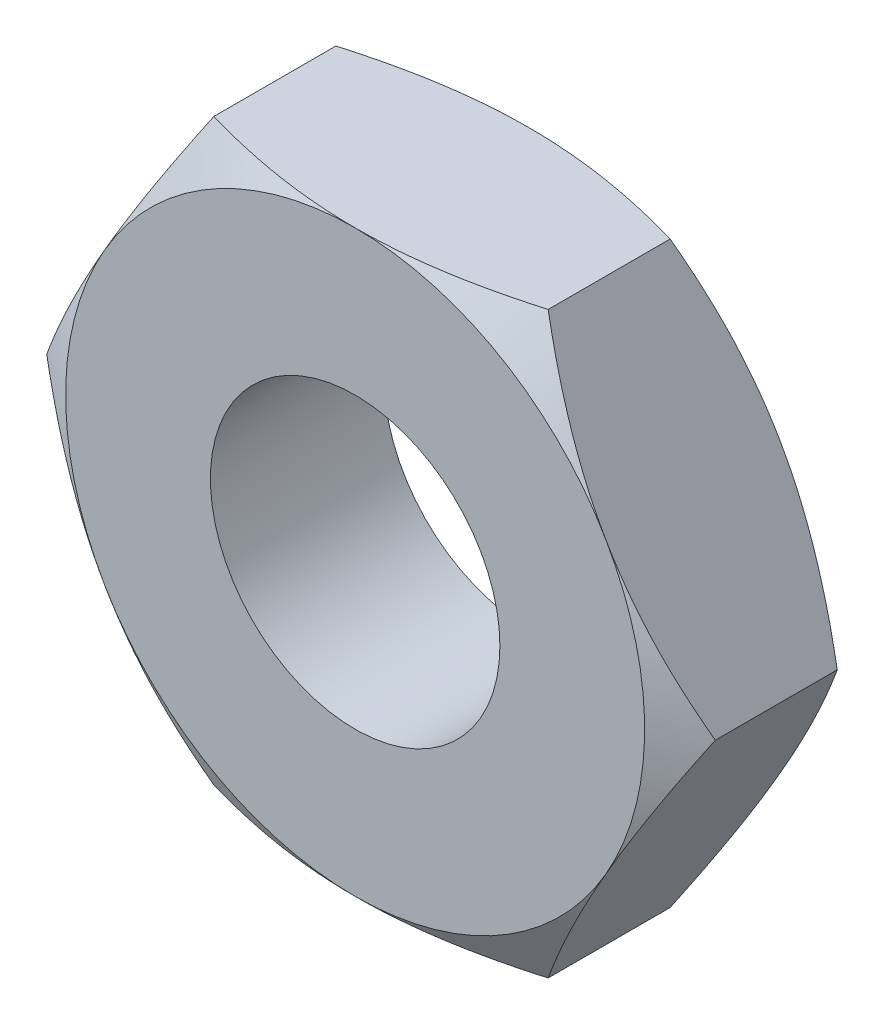
ISO-10303-21;
HEADER;
FILE_DESCRIPTION(('STEP AP214'),'2;1');
FILE_NAME('part.step','',(''),(''),'','','');
FILE_SCHEMA(('AUTOMOTIVE_DESIGN { 1 0 10303 214 1 1 1 1 }'));
ENDSEC;
DATA;
#1=APPLICATION_CONTEXT('core data for automotive mechanical design processes');
#2=APPLICATION_PROTOCOL_DEFINITION('international standard','automotive_design',2000,#1);
#3=PRODUCT_CONTEXT('',#1,'mechanical');
#4=PRODUCT('Part','Part','',(#3));
#5=PRODUCT_RELATED_PRODUCT_CATEGORY('part','',(#4));
#6=PRODUCT_DEFINITION_FORMATION('','',#4);
#7=PRODUCT_DEFINITION_CONTEXT('part definition',#1,'design');
#8=PRODUCT_DEFINITION('design','',#6,#7);
#9=PRODUCT_DEFINITION_SHAPE('','',#8);
#10=(LENGTH_UNIT() NAMED_UNIT(*) SI_UNIT(.MILLI.,.METRE.));
#11=(NAMED_UNIT(*) PLANE_ANGLE_UNIT() SI_UNIT($,.RADIAN.));
#12=(NAMED_UNIT(*) SI_UNIT($,.STERADIAN.) SOLID_ANGLE_UNIT());
#13=UNCERTAINTY_MEASURE_WITH_UNIT(LENGTH_MEASURE(1.E-05),#10,'distance_accuracy_value','');
#14=(GEOMETRIC_REPRESENTATION_CONTEXT(3) GLOBAL_UNCERTAINTY_ASSIGNED_CONTEXT((#13)) GLOBAL_UNIT_ASSIGNED_CONTEXT((#10,
#11,#12)) REPRESENTATION_CONTEXT('',''));
#15=CARTESIAN_POINT('',(0.,0.,0.));
#16=DIRECTION('',(0.,0.,1.));
#17=DIRECTION('',(1.,0.,0.));
#18=AXIS2_PLACEMENT_3D('',#15,#16,#17);
#19=CARTESIAN_POINT('',(2.3094010767585,0.,-1.2));
#20=DIRECTION('',(0.866025403784438,0.5,0.));
#21=DIRECTION('',(-0.5,0.866025403784439,0.));
#22=AXIS2_PLACEMENT_3D('',#19,#20,#21);
#23=PLANE('',#22);
#24=DIRECTION('',(0.,0.,1.));
#25=VECTOR('',#24,1.);
#26=CARTESIAN_POINT('',(2.3094010767585,0.,-1.2));
#27=LINE('',#26,#25);
#28=CARTESIAN_POINT('',(2.3094010767585,0.,-1.02136720504592));
#29=VERTEX_POINT('',#28);
#30=CARTESIAN_POINT('',(2.3094010767585,0.,-0.17863279495408));
#31=VERTEX_POINT('',#30);
#32=EDGE_CURVE('E151',#29,#31,#27,.T.);
#33=ORIENTED_EDGE('',*,*,#32,.F.);
#34=CARTESIAN_POINT('',(2.30951654681234,-0.000199999999999312,-1.0213005333795));
#35=CARTESIAN_POINT('',(2.25877250251758,0.0876912629000608,-1.05061046389932));
#36=CARTESIAN_POINT('',(2.20759044065995,0.176341194473592,-1.07726714801953));
#37=CARTESIAN_POINT('',(2.10433997494456,0.355176246997802,-1.12379750897928));
#38=CARTESIAN_POINT('',(2.0522697359463,0.445364546505037,-1.14365472361722));
#39=CARTESIAN_POINT('',(1.94877459684592,0.624623385763306,-1.17456653597675));
#40=CARTESIAN_POINT('',(1.89736562427197,0.713666338226305,-1.18582684840147));
#41=CARTESIAN_POINT('',(1.79430568008402,0.892171397785044,-1.19927133740536));
#42=CARTESIAN_POINT('',(1.74265508327244,0.981632855703959,-1.20146664504653));
#43=CARTESIAN_POINT('',(1.64613626458981,1.1488083535488,-1.19690901066935));
#44=CARTESIAN_POINT('',(1.60125362236172,1.22654737026578,-1.19127512531299));
#45=CARTESIAN_POINT('',(1.51178075956051,1.38151891453613,-1.17341610473917));
#46=CARTESIAN_POINT('',(1.46719084864821,1.4587509057412,-1.16118486397656));
#47=CARTESIAN_POINT('',(1.37753338590959,1.6140421864822,-1.13060656313239));
#48=CARTESIAN_POINT('',(1.33247718647009,1.69208181310738,-1.11212983293428));
#49=CARTESIAN_POINT('',(1.24303693915875,1.84699686569213,-1.07019448178714));
#50=CARTESIAN_POINT('',(1.1986517446858,1.92387427762312,-1.04674571950769));
#51=CARTESIAN_POINT('',(1.15458506832541,2.0002,-1.0213005333795));
#52=B_SPLINE_CURVE_WITH_KNOTS('',3,(#34,#35,#36,#37,#38,#39,#40,#41,#42,#43,#44,#45,#46,#47,#48,
#49,#50,#51),.UNSPECIFIED.,.F.,.F.,(4,2,2,2,2,2,2,2,4),(0.,0.31703182469561,0.634825876346563,
0.944753967652636,1.25430138000371,1.52387047293094,1.79368946861028,2.06949491027634,
2.34475850821472),.UNSPECIFIED.);
#53=CARTESIAN_POINT('',(1.73205080756888,1.,-1.2));
#54=VERTEX_POINT('',#53);
#55=EDGE_CURVE('E133',#29,#54,#52,.T.);
#56=ORIENTED_EDGE('',*,*,#55,.T.);
#57=CARTESIAN_POINT('',(1.15470053837925,2.,-1.02136720504592));
#58=VERTEX_POINT('',#57);
#59=EDGE_CURVE('E123',#54,#58,#52,.T.);
#60=ORIENTED_EDGE('',*,*,#59,.T.);
#61=DIRECTION('',(0.,0.,1.));
#62=VECTOR('',#61,1.);
#63=CARTESIAN_POINT('',(1.15470053837925,2.,-1.2));
#64=LINE('',#63,#62);
#65=CARTESIAN_POINT('',(1.15470053837925,2.,-0.17863279495408));
#66=VERTEX_POINT('',#65);
#67=EDGE_CURVE('E233',#58,#66,#64,.T.);
#68=ORIENTED_EDGE('',*,*,#67,.T.);
#69=CARTESIAN_POINT('',(1.15458506832541,2.0002,-0.178699466620497));
#70=CARTESIAN_POINT('',(1.20532911262018,1.91230873709994,-0.149389536100678));
#71=CARTESIAN_POINT('',(1.2565111744778,1.82365880552641,-0.122732851980466));
#72=CARTESIAN_POINT('',(1.35976164019319,1.6448237530022,-0.0762024910207205));
#73=CARTESIAN_POINT('',(1.41183187919145,1.55463545349496,-0.0563452763827787));
#74=CARTESIAN_POINT('',(1.51532701829183,1.37537661423669,-0.0254334640232522));
#75=CARTESIAN_POINT('',(1.56673599086578,1.2863336617737,-0.0141731515985309));
#76=CARTESIAN_POINT('',(1.66979593505373,1.10782860221496,-0.000728662594641754));
#77=CARTESIAN_POINT('',(1.72144653186531,1.01836714429604,0.0014666450465319));
#78=CARTESIAN_POINT('',(1.81796535054794,0.851191646451202,-0.00309098933064858));
#79=CARTESIAN_POINT('',(1.86284799277603,0.773452629734217,-0.00872487468701424));
#80=CARTESIAN_POINT('',(1.95232085557725,0.618481085463867,-0.026583895260828));
#81=CARTESIAN_POINT('',(1.99691076648954,0.541249094258802,-0.038815136023439));
#82=CARTESIAN_POINT('',(2.08656822922816,0.3859578135178,-0.0693934368676094));
#83=CARTESIAN_POINT('',(2.13162442866767,0.307918186892621,-0.0878701670657154));
#84=CARTESIAN_POINT('',(2.221064675979,0.153003134307866,-0.129805518212855));
#85=CARTESIAN_POINT('',(2.26544987045196,0.0761257223768809,-0.153254280492313));
#86=CARTESIAN_POINT('',(2.30951654681234,-0.000199999999999199,-0.178699466620497));
#87=B_SPLINE_CURVE_WITH_KNOTS('',3,(#69,#70,#71,#72,#73,#74,#75,#76,#77,#78,#79,#80,#81,#82,#83,
#84,#85,#86),.UNSPECIFIED.,.F.,.F.,(4,2,2,2,2,2,2,2,4),(0.,0.317031824695609,0.634825876346563,
0.944753967652635,1.25430138000371,1.52387047293094,1.79368946861028,2.06949491027634,
2.34475850821472),.UNSPECIFIED.);
#88=CARTESIAN_POINT('',(1.73205080756888,1.,0.));
#89=VERTEX_POINT('',#88);
#90=EDGE_CURVE('E229',#66,#89,#87,.T.);
#91=ORIENTED_EDGE('',*,*,#90,.T.);
#92=EDGE_CURVE('E224',#89,#31,#87,.T.);
#93=ORIENTED_EDGE('',*,*,#92,.T.);
#94=EDGE_LOOP('',(#33,#56,#60,#68,#91,#93));
#95=FACE_BOUND('',#94,.T.);
#96=ADVANCED_FACE('F36',(#95),#23,.T.);
#97=CARTESIAN_POINT('',(1.15470053837925,-2.,-1.2));
#98=DIRECTION('',(0.866025403784439,-0.5,0.));
#99=DIRECTION('',(0.5,0.866025403784439,0.));
#100=AXIS2_PLACEMENT_3D('',#97,#98,#99);
#101=PLANE('',#100);
#102=DIRECTION('',(0.,0.,1.));
#103=VECTOR('',#102,1.);
#104=CARTESIAN_POINT('',(1.15470053837925,-2.,-1.2));
#105=LINE('',#104,#103);
#106=CARTESIAN_POINT('',(1.15470053837925,-2.,-1.02136720504592));
#107=VERTEX_POINT('',#106);
#108=CARTESIAN_POINT('',(1.15470053837925,-2.,-0.17863279495408));
#109=VERTEX_POINT('',#108);
#110=EDGE_CURVE('E239',#107,#109,#105,.T.);
#111=ORIENTED_EDGE('',*,*,#110,.F.);
#112=CARTESIAN_POINT('',(1.15458506832541,-2.0002,-1.0213005333795));
#113=CARTESIAN_POINT('',(1.20532911262018,-1.91230873709994,-1.05061046389932));
#114=CARTESIAN_POINT('',(1.2565111744778,-1.82365880552641,-1.07726714801953));
#115=CARTESIAN_POINT('',(1.35976164019319,-1.6448237530022,-1.12379750897928));
#116=CARTESIAN_POINT('',(1.41183187919145,-1.55463545349496,-1.14365472361722));
#117=CARTESIAN_POINT('',(1.51532701829183,-1.37537661423669,-1.17456653597675));
#118=CARTESIAN_POINT('',(1.56673599086578,-1.2863336617737,-1.18582684840147));
#119=CARTESIAN_POINT('',(1.66979593505373,-1.10782860221496,-1.19927133740536));
#120=CARTESIAN_POINT('',(1.72144653186531,-1.01836714429604,-1.20146664504653));
#121=CARTESIAN_POINT('',(1.81796535054794,-0.851191646451202,-1.19690901066935));
#122=CARTESIAN_POINT('',(1.86284799277603,-0.773452629734217,-1.19127512531299));
#123=CARTESIAN_POINT('',(1.95232085557725,-0.618481085463867,-1.17341610473917));
#124=CARTESIAN_POINT('',(1.99691076648954,-0.541249094258802,-1.16118486397656));
#125=CARTESIAN_POINT('',(2.08656822922816,-0.385957813517799,-1.13060656313239));
#126=CARTESIAN_POINT('',(2.13162442866767,-0.307918186892621,-1.11212983293428));
#127=CARTESIAN_POINT('',(2.221064675979,-0.153003134307865,-1.07019448178714));
#128=CARTESIAN_POINT('',(2.26544987045196,-0.0761257223768795,-1.04674571950769));
#129=CARTESIAN_POINT('',(2.30951654681234,0.000200000000000674,-1.0213005333795));
#130=B_SPLINE_CURVE_WITH_KNOTS('',3,(#112,#113,#114,#115,#116,#117,#118,#119,#120,#121,#122,
#123,#124,#125,#126,#127,#128,#129),.UNSPECIFIED.,.F.,.F.,(4,2,2,2,2,2,2,2,4),(0.,
0.31703182469561,0.634825876346564,0.944753967652636,1.25430138000371,1.52387047293094,
1.79368946861028,2.06949491027634,2.34475850821472),.UNSPECIFIED.);
#131=CARTESIAN_POINT('',(1.73205080756888,-0.999999999999999,-1.2));
#132=VERTEX_POINT('',#131);
#133=EDGE_CURVE('E192',#107,#132,#130,.T.);
#134=ORIENTED_EDGE('',*,*,#133,.T.);
#135=EDGE_CURVE('E139',#132,#29,#130,.T.);
#136=ORIENTED_EDGE('',*,*,#135,.T.);
#137=ORIENTED_EDGE('',*,*,#32,.T.);
#138=CARTESIAN_POINT('',(2.30951654681234,0.000200000000000737,-0.178699466620497));
#139=CARTESIAN_POINT('',(2.25877250251758,-0.0876912629000593,-0.149389536100678));
#140=CARTESIAN_POINT('',(2.20759044065995,-0.176341194473591,-0.122732851980466));
#141=CARTESIAN_POINT('',(2.10433997494456,-0.355176246997801,-0.0762024910207204));
#142=CARTESIAN_POINT('',(2.0522697359463,-0.445364546505036,-0.0563452763827786));
#143=CARTESIAN_POINT('',(1.94877459684592,-0.624623385763305,-0.0254334640232523));
#144=CARTESIAN_POINT('',(1.89736562427197,-0.713666338226303,-0.014173151598531));
#145=CARTESIAN_POINT('',(1.79430568008402,-0.892171397785042,-0.000728662594641788));
#146=CARTESIAN_POINT('',(1.74265508327244,-0.981632855703957,0.00146664504653197));
#147=CARTESIAN_POINT('',(1.64613626458981,-1.1488083535488,-0.00309098933064852));
#148=CARTESIAN_POINT('',(1.60125362236173,-1.22654737026578,-0.00872487468701427));
#149=CARTESIAN_POINT('',(1.51178075956051,-1.38151891453613,-0.026583895260828));
#150=CARTESIAN_POINT('',(1.46719084864821,-1.4587509057412,-0.038815136023439));
#151=CARTESIAN_POINT('',(1.37753338590959,-1.6140421864822,-0.0693934368676094));
#152=CARTESIAN_POINT('',(1.33247718647009,-1.69208181310738,-0.0878701670657155));
#153=CARTESIAN_POINT('',(1.24303693915875,-1.84699686569214,-0.129805518212855));
#154=CARTESIAN_POINT('',(1.1986517446858,-1.92387427762312,-0.153254280492313));
#155=CARTESIAN_POINT('',(1.15458506832541,-2.0002,-0.178699466620497));
#156=B_SPLINE_CURVE_WITH_KNOTS('',3,(#138,#139,#140,#141,#142,#143,#144,#145,#146,#147,#148,
#149,#150,#151,#152,#153,#154,#155),.UNSPECIFIED.,.F.,.F.,(4,2,2,2,2,2,2,2,4),(0.,
0.31703182469561,0.634825876346563,0.944753967652635,1.25430138000371,1.52387047293094,
1.79368946861028,2.06949491027634,2.34475850821472),.UNSPECIFIED.);
#157=CARTESIAN_POINT('',(1.73205080756888,-0.999999999999999,0.));
#158=VERTEX_POINT('',#157);
#159=EDGE_CURVE('E217',#31,#158,#156,.T.);
#160=ORIENTED_EDGE('',*,*,#159,.T.);
#161=EDGE_CURVE('E210',#158,#109,#156,.T.);
#162=ORIENTED_EDGE('',*,*,#161,.T.);
#163=EDGE_LOOP('',(#111,#134,#136,#137,#160,#162));
#164=FACE_BOUND('',#163,.T.);
#165=ADVANCED_FACE('F199',(#164),#101,.T.);
#166=CARTESIAN_POINT('',(-1.15470053837924,-2.,-1.2));
#167=DIRECTION('',(0.,-1.,0.));
#168=DIRECTION('',(1.,0.,0.));
#169=AXIS2_PLACEMENT_3D('',#166,#167,#168);
#170=PLANE('',#169);
#171=DIRECTION('',(0.,0.,1.));
#172=VECTOR('',#171,1.);
#173=CARTESIAN_POINT('',(-1.15470053837924,-2.,-1.2));
#174=LINE('',#173,#172);
#175=CARTESIAN_POINT('',(-1.15470053837925,-2.,-1.02136720504592));
#176=VERTEX_POINT('',#175);
#177=CARTESIAN_POINT('',(-1.15470053837924,-2.,-0.17863279495408));
#178=VERTEX_POINT('',#177);
#179=EDGE_CURVE('E241',#176,#178,#174,.T.);
#180=ORIENTED_EDGE('',*,*,#179,.F.);
#181=CARTESIAN_POINT('',(-3.06243670884926,-2.,-0.242946244298342));
#182=CARTESIAN_POINT('',(-2.97462537456477,-2.,-0.285381534351306));
#183=CARTESIAN_POINT('',(-2.88660642542278,-2.,-0.327394982561969));
#184=CARTESIAN_POINT('',(-2.7100410399043,-2.,-0.410337140450311));
#185=CARTESIAN_POINT('',(-2.62149451540736,-2.,-0.451265662317576));
#186=CARTESIAN_POINT('',(-2.44328340033097,-2.,-0.532012526437257));
#187=CARTESIAN_POINT('',(-2.35361531124172,-2.,-0.571823175245811));
#188=CARTESIAN_POINT('',(-2.17354214087982,-2.,-0.649734508801147));
#189=CARTESIAN_POINT('',(-2.08313709831417,-2.,-0.687835282680517));
#190=CARTESIAN_POINT('',(-1.90031444024273,-2.,-0.762328384320371));
#191=CARTESIAN_POINT('',(-1.80788576524896,-2.,-0.798693718617557));
#192=CARTESIAN_POINT('',(-1.62195726259726,-2.,-0.86856868085399));
#193=CARTESIAN_POINT('',(-1.52845753767457,-2.,-0.902078580127572));
#194=CARTESIAN_POINT('',(-1.34040182163335,-2.,-0.965354047517777));
#195=CARTESIAN_POINT('',(-1.24584841059272,-2.,-0.995127205245311));
#196=CARTESIAN_POINT('',(-1.05539744088343,-2.,-1.04995829551407));
#197=CARTESIAN_POINT('',(-0.959500317628249,-2.,-1.07501771917808));
#198=CARTESIAN_POINT('',(-0.766296162175127,-2.,-1.11920453723145));
#199=CARTESIAN_POINT('',(-0.668988761573955,-2.,-1.13833035125961));
#200=CARTESIAN_POINT('',(-0.473201499243397,-2.,-1.16936309767364));
#201=CARTESIAN_POINT('',(-0.374721636478249,-2.,-1.1812700236818));
#202=CARTESIAN_POINT('',(-0.177725007165872,-2.,-1.19680834640598));
#203=CARTESIAN_POINT('',(-0.0792124969842873,-2.,-1.20049213387509));
#204=CARTESIAN_POINT('',(0.117733470493257,-2.,-1.19940077932984));
#205=CARTESIAN_POINT('',(0.216166941672619,-2.,-1.19462783307904));
#206=CARTESIAN_POINT('',(0.454297669729619,-2.,-1.17327562968436));
#207=CARTESIAN_POINT('',(0.593620948553316,-2.,-1.15251698104436));
#208=CARTESIAN_POINT('',(0.869689823834487,-2.,-1.09780038675936));
#209=CARTESIAN_POINT('',(1.00643218834849,-2.,-1.06382691165978));
#210=CARTESIAN_POINT('',(1.21108764008849,-2.,-1.00524088268493));
#211=CARTESIAN_POINT('',(1.28004713727273,-2.,-0.984142640748009));
#212=CARTESIAN_POINT('',(1.4172425327793,-2.,-0.939857712838905));
#213=CARTESIAN_POINT('',(1.48547889440396,-2.,-0.916672467332592));
#214=CARTESIAN_POINT('',(1.62094752446184,-2.,-0.86869685863592));
#215=CARTESIAN_POINT('',(1.68818328274558,-2.,-0.843916264681625));
#216=CARTESIAN_POINT('',(1.82213314125819,-2.,-0.792900589660032));
#217=CARTESIAN_POINT('',(1.88884701804143,-2.,-0.766664920738091));
#218=CARTESIAN_POINT('',(1.95531919268194,-2.,-0.739845215110288));
#219=B_SPLINE_CURVE_WITH_KNOTS('',3,(#181,#182,#183,#184,#185,#186,#187,#188,#189,#190,#191,
#192,#193,#194,#195,#196,#197,#198,#199,#200,#201,#202,#203,#204,#205,#206,#207,#208,#209,#210,
#211,#212,#213,#214,#215,#216,#217,#218),.UNSPECIFIED.,.F.,.F.,(4,2,2,2,2,2,2,2,2,2,2,2,2,2,2,2,
2,2,4),(0.,0.292585981547725,0.585222285876961,0.879533230089777,1.17382881455956,
1.47176815658413,1.76967915563007,2.06697493039128,2.36417650111644,2.66145716086699,
2.95873808325712,3.2541195157486,3.54942426464478,3.9711430779806,4.39335898038569,
4.60967797518337,4.82584879332086,5.04080285667119,5.25584440381786),.UNSPECIFIED.);
#220=CARTESIAN_POINT('',(0.,-2.,-1.2));
#221=VERTEX_POINT('',#220);
#222=EDGE_CURVE('E318',#176,#221,#219,.T.);
#223=ORIENTED_EDGE('',*,*,#222,.T.);
#224=EDGE_CURVE('E193',#221,#107,#219,.T.);
#225=ORIENTED_EDGE('',*,*,#224,.T.);
#226=ORIENTED_EDGE('',*,*,#110,.T.);
#227=CARTESIAN_POINT('',(-3.06243670884926,-2.,-0.957053755701653));
#228=CARTESIAN_POINT('',(-2.97462537456477,-2.,-0.91461846564869));
#229=CARTESIAN_POINT('',(-2.88660642542278,-2.,-0.872605017438026));
#230=CARTESIAN_POINT('',(-2.7100410399043,-2.,-0.789662859549685));
#231=CARTESIAN_POINT('',(-2.62149451540736,-2.,-0.74873433768242));
#232=CARTESIAN_POINT('',(-2.44328340033097,-2.,-0.66798747356274));
#233=CARTESIAN_POINT('',(-2.35361531124171,-2.,-0.628176824754186));
#234=CARTESIAN_POINT('',(-2.17354214087982,-2.,-0.55026549119885));
#235=CARTESIAN_POINT('',(-2.08313709831417,-2.,-0.51216471731948));
#236=CARTESIAN_POINT('',(-1.90031444024273,-2.,-0.437671615679627));
#237=CARTESIAN_POINT('',(-1.80788576524895,-2.,-0.40130628138244));
#238=CARTESIAN_POINT('',(-1.62195726259725,-2.,-0.331431319146008));
#239=CARTESIAN_POINT('',(-1.52845753767457,-2.,-0.297921419872426));
#240=CARTESIAN_POINT('',(-1.34040182163335,-2.,-0.234645952482221));
#241=CARTESIAN_POINT('',(-1.24584841059272,-2.,-0.204872794754688));
#242=CARTESIAN_POINT('',(-1.05539744088343,-2.,-0.150041704485925));
#243=CARTESIAN_POINT('',(-0.959500317628249,-2.,-0.124982280821916));
#244=CARTESIAN_POINT('',(-0.766296162175126,-2.,-0.0807954627685529));
#245=CARTESIAN_POINT('',(-0.668988761573955,-2.,-0.0616696487403929));
#246=CARTESIAN_POINT('',(-0.473201499243398,-2.,-0.0306369023263644));
#247=CARTESIAN_POINT('',(-0.37472163647825,-2.,-0.0187299763182013));
#248=CARTESIAN_POINT('',(-0.177725007165873,-2.,-0.00319165359402001));
#249=CARTESIAN_POINT('',(-0.079212496984288,-2.,0.000492133875092076));
#250=CARTESIAN_POINT('',(0.117733470493257,-2.,-0.000599220670161883));
#251=CARTESIAN_POINT('',(0.216166941672618,-2.,-0.00537216692095547));
#252=CARTESIAN_POINT('',(0.454297669729619,-2.,-0.0267243703156365));
#253=CARTESIAN_POINT('',(0.593620948553316,-2.,-0.0474830189556355));
#254=CARTESIAN_POINT('',(0.86968982383449,-2.,-0.102199613240639));
#255=CARTESIAN_POINT('',(1.0064321883485,-2.,-0.136173088340221));
#256=CARTESIAN_POINT('',(1.21108764008849,-2.,-0.194759117315066));
#257=CARTESIAN_POINT('',(1.28004713727273,-2.,-0.215857359251991));
#258=CARTESIAN_POINT('',(1.41724253277931,-2.,-0.260142287161096));
#259=CARTESIAN_POINT('',(1.48547889440396,-2.,-0.283327532667408));
#260=CARTESIAN_POINT('',(1.62094752446184,-2.,-0.33130314136408));
#261=CARTESIAN_POINT('',(1.68818328274558,-2.,-0.356083735318376));
#262=CARTESIAN_POINT('',(1.8221331412582,-2.,-0.407099410339969));
#263=CARTESIAN_POINT('',(1.88884701804143,-2.,-0.433335079261909));
#264=CARTESIAN_POINT('',(1.95531919268194,-2.,-0.460154784889712));
#265=B_SPLINE_CURVE_WITH_KNOTS('',3,(#227,#228,#229,#230,#231,#232,#233,#234,#235,#236,#237,
#238,#239,#240,#241,#242,#243,#244,#245,#246,#247,#248,#249,#250,#251,#252,#253,#254,#255,#256,
#257,#258,#259,#260,#261,#262,#263,#264),.UNSPECIFIED.,.F.,.F.,(4,2,2,2,2,2,2,2,2,2,2,2,2,2,2,2,
2,2,4),(0.,0.292585981547725,0.585222285876962,0.879533230089778,1.17382881455956,
1.47176815658413,1.76967915563007,2.06697493039128,2.36417650111644,2.66145716086699,
2.95873808325711,3.2541195157486,3.54942426464477,3.9711430779806,4.39335898038569,
4.60967797518337,4.82584879332087,5.04080285667119,5.25584440381786),.UNSPECIFIED.);
#266=CARTESIAN_POINT('',(0.,-2.,0.));
#267=VERTEX_POINT('',#266);
#268=EDGE_CURVE('E218',#109,#267,#265,.F.);
#269=ORIENTED_EDGE('',*,*,#268,.T.);
#270=EDGE_CURVE('E219',#267,#178,#265,.F.);
#271=ORIENTED_EDGE('',*,*,#270,.T.);
#272=EDGE_LOOP('',(#180,#223,#225,#226,#269,#271));
#273=FACE_BOUND('',#272,.T.);
#274=ADVANCED_FACE('F203',(#273),#170,.T.);
#275=CARTESIAN_POINT('',(-2.3094010767585,0.,-1.2));
#276=DIRECTION('',(-0.866025403784438,-0.500000000000001,0.));
#277=DIRECTION('',(0.500000000000001,-0.866025403784438,0.));
#278=AXIS2_PLACEMENT_3D('',#275,#276,#277);
#279=PLANE('',#278);
#280=DIRECTION('',(0.,0.,1.));
#281=VECTOR('',#280,1.);
#282=CARTESIAN_POINT('',(-2.3094010767585,0.,-1.2));
#283=LINE('',#282,#281);
#284=CARTESIAN_POINT('',(-2.3094010767585,0.,-1.02136720504592));
#285=VERTEX_POINT('',#284);
#286=CARTESIAN_POINT('',(-2.3094010767585,0.,-0.17863279495408));
#287=VERTEX_POINT('',#286);
#288=EDGE_CURVE('E243',#285,#287,#283,.T.);
#289=ORIENTED_EDGE('',*,*,#288,.F.);
#290=CARTESIAN_POINT('',(-2.30951654681234,0.00019999999999843,-1.0213005333795));
#291=CARTESIAN_POINT('',(-2.25877250251757,-0.0876912629000613,-1.05061046389932));
#292=CARTESIAN_POINT('',(-2.20759044065995,-0.176341194473593,-1.07726714801954));
#293=CARTESIAN_POINT('',(-2.10433997494456,-0.355176246997803,-1.12379750897928));
#294=CARTESIAN_POINT('',(-2.0522697359463,-0.445364546505037,-1.14365472361722));
#295=CARTESIAN_POINT('',(-1.94877459684592,-0.624623385763306,-1.17456653597675));
#296=CARTESIAN_POINT('',(-1.89736562427197,-0.713666338226304,-1.18582684840147));
#297=CARTESIAN_POINT('',(-1.79430568008402,-0.892171397785042,-1.19927133740536));
#298=CARTESIAN_POINT('',(-1.74265508327244,-0.981632855703957,-1.20146664504653));
#299=CARTESIAN_POINT('',(-1.64613626458981,-1.1488083535488,-1.19690901066935));
#300=CARTESIAN_POINT('',(-1.60125362236172,-1.22654737026578,-1.19127512531299));
#301=CARTESIAN_POINT('',(-1.5117807595605,-1.38151891453613,-1.17341610473917));
#302=CARTESIAN_POINT('',(-1.46719084864821,-1.4587509057412,-1.16118486397656));
#303=CARTESIAN_POINT('',(-1.37753338590959,-1.6140421864822,-1.13060656313239));
#304=CARTESIAN_POINT('',(-1.33247718647008,-1.69208181310738,-1.11212983293429));
#305=CARTESIAN_POINT('',(-1.24303693915875,-1.84699686569214,-1.07019448178715));
#306=CARTESIAN_POINT('',(-1.19865174468579,-1.92387427762312,-1.04674571950769));
#307=CARTESIAN_POINT('',(-1.15458506832541,-2.0002,-1.0213005333795));
#308=B_SPLINE_CURVE_WITH_KNOTS('',3,(#290,#291,#292,#293,#294,#295,#296,#297,#298,#299,#300,
#301,#302,#303,#304,#305,#306,#307),.UNSPECIFIED.,.F.,.F.,(4,2,2,2,2,2,2,2,4),(0.,
0.317031824695609,0.634825876346562,0.944753967652634,1.25430138000371,1.52387047293094,
1.79368946861028,2.06949491027634,2.34475850821473),.UNSPECIFIED.);
#309=CARTESIAN_POINT('',(-1.73205080756888,-1.,-1.2));
#310=VERTEX_POINT('',#309);
#311=EDGE_CURVE('E154',#285,#310,#308,.T.);
#312=ORIENTED_EDGE('',*,*,#311,.T.);
#313=EDGE_CURVE('E322',#310,#176,#308,.T.);
#314=ORIENTED_EDGE('',*,*,#313,.T.);
#315=ORIENTED_EDGE('',*,*,#179,.T.);
#316=CARTESIAN_POINT('',(-1.15458506832541,-2.0002,-0.178699466620496));
#317=CARTESIAN_POINT('',(-1.20532911262017,-1.91230873709994,-0.149389536100677));
#318=CARTESIAN_POINT('',(-1.25651117447779,-1.82365880552641,-0.122732851980465));
#319=CARTESIAN_POINT('',(-1.35976164019319,-1.6448237530022,-0.0762024910207194));
#320=CARTESIAN_POINT('',(-1.41183187919144,-1.55463545349497,-0.0563452763827774));
#321=CARTESIAN_POINT('',(-1.51532701829182,-1.3753766142367,-0.0254334640232507));
#322=CARTESIAN_POINT('',(-1.56673599086578,-1.2863336617737,-0.0141731515985293));
#323=CARTESIAN_POINT('',(-1.66979593505372,-1.10782860221496,-0.000728662594639881));
#324=CARTESIAN_POINT('',(-1.72144653186531,-1.01836714429605,0.00146664504653401));
#325=CARTESIAN_POINT('',(-1.81796535054793,-0.851191646451206,-0.00309098933064626));
#326=CARTESIAN_POINT('',(-1.86284799277602,-0.77345262973422,-0.00872487468701195));
#327=CARTESIAN_POINT('',(-1.95232085557724,-0.61848108546387,-0.0265838952608255));
#328=CARTESIAN_POINT('',(-1.99691076648954,-0.541249094258805,-0.0388151360234364));
#329=CARTESIAN_POINT('',(-2.08656822922816,-0.385957813517802,-0.0693934368676067));
#330=CARTESIAN_POINT('',(-2.13162442866766,-0.307918186892623,-0.0878701670657127));
#331=CARTESIAN_POINT('',(-2.221064675979,-0.153003134307867,-0.129805518212853));
#332=CARTESIAN_POINT('',(-2.26544987045195,-0.0761257223768817,-0.15325428049231));
#333=CARTESIAN_POINT('',(-2.30951654681234,0.000199999999998705,-0.178699466620495));
#334=B_SPLINE_CURVE_WITH_KNOTS('',3,(#316,#317,#318,#319,#320,#321,#322,#323,#324,#325,#326,
#327,#328,#329,#330,#331,#332,#333),.UNSPECIFIED.,.F.,.F.,(4,2,2,2,2,2,2,2,4),(0.,
0.31703182469561,0.634825876346563,0.944753967652634,1.25430138000371,1.52387047293094,
1.79368946861028,2.06949491027634,2.34475850821473),.UNSPECIFIED.);
#335=CARTESIAN_POINT('',(-1.73205080756888,-1.,0.));
#336=VERTEX_POINT('',#335);
#337=EDGE_CURVE('E283',#178,#336,#334,.T.);
#338=ORIENTED_EDGE('',*,*,#337,.T.);
#339=EDGE_CURVE('E284',#336,#287,#334,.T.);
#340=ORIENTED_EDGE('',*,*,#339,.T.);
#341=EDGE_LOOP('',(#289,#312,#314,#315,#338,#340));
#342=FACE_BOUND('',#341,.T.);
#343=ADVANCED_FACE('F297',(#342),#279,.T.);
#344=CARTESIAN_POINT('',(-1.15470053837925,2.,-1.2));
#345=DIRECTION('',(-0.866025403784439,0.499999999999999,0.));
#346=DIRECTION('',(-0.5,-0.866025403784439,0.));
#347=AXIS2_PLACEMENT_3D('',#344,#345,#346);
#348=PLANE('',#347);
#349=DIRECTION('',(0.,0.,1.));
#350=VECTOR('',#349,1.);
#351=CARTESIAN_POINT('',(-1.15470053837925,2.,-1.2));
#352=LINE('',#351,#350);
#353=CARTESIAN_POINT('',(-1.15470053837925,2.,-1.02136720504592));
#354=VERTEX_POINT('',#353);
#355=CARTESIAN_POINT('',(-1.15470053837925,2.,-0.17863279495408));
#356=VERTEX_POINT('',#355);
#357=EDGE_CURVE('E245',#354,#356,#352,.T.);
#358=ORIENTED_EDGE('',*,*,#357,.F.);
#359=CARTESIAN_POINT('',(-1.15458506832541,2.0002,-1.0213005333795));
#360=CARTESIAN_POINT('',(-1.20532911262018,1.91230873709994,-1.05061046389932));
#361=CARTESIAN_POINT('',(-1.2565111744778,1.82365880552641,-1.07726714801953));
#362=CARTESIAN_POINT('',(-1.35976164019319,1.6448237530022,-1.12379750897928));
#363=CARTESIAN_POINT('',(-1.41183187919145,1.55463545349496,-1.14365472361722));
#364=CARTESIAN_POINT('',(-1.51532701829183,1.37537661423669,-1.17456653597675));
#365=CARTESIAN_POINT('',(-1.56673599086578,1.2863336617737,-1.18582684840147));
#366=CARTESIAN_POINT('',(-1.66979593505373,1.10782860221496,-1.19927133740536));
#367=CARTESIAN_POINT('',(-1.72144653186531,1.01836714429604,-1.20146664504653));
#368=CARTESIAN_POINT('',(-1.81796535054794,0.851191646451202,-1.19690901066935));
#369=CARTESIAN_POINT('',(-1.86284799277602,0.773452629734216,-1.19127512531299));
#370=CARTESIAN_POINT('',(-1.95232085557724,0.618481085463866,-1.17341610473917));
#371=CARTESIAN_POINT('',(-1.99691076648954,0.541249094258801,-1.16118486397656));
#372=CARTESIAN_POINT('',(-2.08656822922816,0.385957813517799,-1.13060656313239));
#373=CARTESIAN_POINT('',(-2.13162442866766,0.30791818689262,-1.11212983293429));
#374=CARTESIAN_POINT('',(-2.221064675979,0.153003134307864,-1.07019448178715));
#375=CARTESIAN_POINT('',(-2.26544987045195,0.0761257223768789,-1.04674571950769));
#376=CARTESIAN_POINT('',(-2.30951654681234,-0.000200000000001487,-1.0213005333795));
#377=B_SPLINE_CURVE_WITH_KNOTS('',3,(#359,#360,#361,#362,#363,#364,#365,#366,#367,#368,#369,
#370,#371,#372,#373,#374,#375,#376),.UNSPECIFIED.,.F.,.F.,(4,2,2,2,2,2,2,2,4),(0.,
0.31703182469561,0.634825876346563,0.944753967652635,1.25430138000371,1.52387047293094,
1.79368946861028,2.06949491027634,2.34475850821472),.UNSPECIFIED.);
#378=CARTESIAN_POINT('',(-1.73205080756888,0.999999999999999,-1.2));
#379=VERTEX_POINT('',#378);
#380=EDGE_CURVE('E54',#354,#379,#377,.T.);
#381=ORIENTED_EDGE('',*,*,#380,.T.);
#382=EDGE_CURVE('E152',#379,#285,#377,.T.);
#383=ORIENTED_EDGE('',*,*,#382,.T.);
#384=ORIENTED_EDGE('',*,*,#288,.T.);
#385=CARTESIAN_POINT('',(-2.30951654681234,-0.000200000000001596,-0.178699466620494));
#386=CARTESIAN_POINT('',(-2.25877250251757,0.0876912629000585,-0.149389536100676));
#387=CARTESIAN_POINT('',(-2.20759044065995,0.17634119447359,-0.122732851980464));
#388=CARTESIAN_POINT('',(-2.10433997494456,0.3551762469978,-0.0762024910207184));
#389=CARTESIAN_POINT('',(-2.0522697359463,0.445364546505034,-0.0563452763827766));
#390=CARTESIAN_POINT('',(-1.94877459684592,0.624623385763303,-0.0254334640232503));
#391=CARTESIAN_POINT('',(-1.89736562427197,0.713666338226301,-0.014173151598529));
#392=CARTESIAN_POINT('',(-1.79430568008402,0.89217139778504,-0.000728662594639785));
#393=CARTESIAN_POINT('',(-1.74265508327244,0.981632855703955,0.00146664504653397));
#394=CARTESIAN_POINT('',(-1.64613626458981,1.14880835354879,-0.00309098933064657));
#395=CARTESIAN_POINT('',(-1.60125362236172,1.22654737026578,-0.00872487468701237));
#396=CARTESIAN_POINT('',(-1.5117807595605,1.38151891453613,-0.0265838952608262));
#397=CARTESIAN_POINT('',(-1.46719084864821,1.4587509057412,-0.0388151360234372));
#398=CARTESIAN_POINT('',(-1.37753338590959,1.6140421864822,-0.0693934368676076));
#399=CARTESIAN_POINT('',(-1.33247718647008,1.69208181310738,-0.0878701670657137));
#400=CARTESIAN_POINT('',(-1.24303693915875,1.84699686569213,-0.129805518212853));
#401=CARTESIAN_POINT('',(-1.19865174468579,1.92387427762312,-0.153254280492311));
#402=CARTESIAN_POINT('',(-1.15458506832541,2.0002,-0.178699466620495));
#403=B_SPLINE_CURVE_WITH_KNOTS('',3,(#385,#386,#387,#388,#389,#390,#391,#392,#393,#394,#395,
#396,#397,#398,#399,#400,#401,#402),.UNSPECIFIED.,.F.,.F.,(4,2,2,2,2,2,2,2,4),(0.,
0.317031824695609,0.634825876346562,0.944753967652633,1.25430138000371,1.52387047293093,
1.79368946861028,2.06949491027634,2.34475850821472),.UNSPECIFIED.);
#404=CARTESIAN_POINT('',(-1.73205080756888,0.999999999999999,0.));
#405=VERTEX_POINT('',#404);
#406=EDGE_CURVE('E287',#287,#405,#403,.T.);
#407=ORIENTED_EDGE('',*,*,#406,.T.);
#408=EDGE_CURVE('E292',#405,#356,#403,.T.);
#409=ORIENTED_EDGE('',*,*,#408,.T.);
#410=EDGE_LOOP('',(#358,#381,#383,#384,#407,#409));
#411=FACE_BOUND('',#410,.T.);
#412=ADVANCED_FACE('F300',(#411),#348,.T.);
#413=CARTESIAN_POINT('',(1.15470053837925,2.,-1.2));
#414=DIRECTION('',(0.,1.,0.));
#415=DIRECTION('',(-1.,0.,0.));
#416=AXIS2_PLACEMENT_3D('',#413,#414,#415);
#417=PLANE('',#416);
#418=ORIENTED_EDGE('',*,*,#67,.F.);
#419=CARTESIAN_POINT('',(-3.06243599497945,2.,-0.242946589379689));
#420=CARTESIAN_POINT('',(-2.97462468513201,2.,-0.285381864667557));
#421=CARTESIAN_POINT('',(-2.88660576044574,2.,-0.327395298121811));
#422=CARTESIAN_POINT('',(-2.71004042392045,2.,-0.41033742657592));
#423=CARTESIAN_POINT('',(-2.62149392396102,2.,-0.451265933765376));
#424=CARTESIAN_POINT('',(-2.44328285836992,2.,-0.532012768522036));
#425=CARTESIAN_POINT('',(-2.35361479423019,2.,-0.571823402648508));
#426=CARTESIAN_POINT('',(-2.17354167395291,2.,-0.649734707109847));
#427=CARTESIAN_POINT('',(-2.08313665652234,2.,-0.687835466577276));
#428=CARTESIAN_POINT('',(-1.90031404940484,2.,-0.762328539637907));
#429=CARTESIAN_POINT('',(-1.80788540023433,2.,-0.798693859775678));
#430=CARTESIAN_POINT('',(-1.6219569496476,2.,-0.86856879448493));
#431=CARTESIAN_POINT('',(-1.52845725096657,2.,-0.902078680390603));
#432=CARTESIAN_POINT('',(-1.34040158791133,2.,-0.965354122372861));
#433=CARTESIAN_POINT('',(-1.24584820361333,2.,-0.995127268056318));
#434=CARTESIAN_POINT('',(-1.05539728812542,2.,-1.0499583362749));
#435=CARTESIAN_POINT('',(-0.959500192348558,2.,-1.07501774993149));
#436=CARTESIAN_POINT('',(-0.766296107056171,2.,-1.11920454773855));
#437=CARTESIAN_POINT('',(-0.668988749343048,2.,-1.13833035240976));
#438=CARTESIAN_POINT('',(-0.473201573751657,2.,-1.16936308665098));
#439=CARTESIAN_POINT('',(-0.374721754836863,2.,-1.18127000983859));
#440=CARTESIAN_POINT('',(-0.177725213014455,2.,-1.19680833464032));
#441=CARTESIAN_POINT('',(-0.0792127464695915,2.,-1.20049212694298));
#442=CARTESIAN_POINT('',(0.117733134481548,2.,-1.19940078951715));
#443=CARTESIAN_POINT('',(0.216166562771046,2.,-1.19462785555389));
#444=CARTESIAN_POINT('',(0.454297223248129,2.,-1.17327568608797));
#445=CARTESIAN_POINT('',(0.593620477818544,2.,-1.15251705811094));
#446=CARTESIAN_POINT('',(0.86968930625478,2.,-1.09780050572932));
#447=CARTESIAN_POINT('',(1.00643164818023,2.,-1.06382705187579));
#448=CARTESIAN_POINT('',(1.21108706615396,2.,-1.00524105434464));
#449=CARTESIAN_POINT('',(1.28004655189502,2.,-0.984142822967431));
#450=CARTESIAN_POINT('',(1.41724192464573,2.,-0.939857915871669));
#451=CARTESIAN_POINT('',(1.4854782749575,2.,-0.916672680618839));
#452=CARTESIAN_POINT('',(1.62094688255355,2.,-0.868697092028027));
#453=CARTESIAN_POINT('',(1.68818262968756,2.,-0.843916507926394));
#454=CARTESIAN_POINT('',(1.82213246587636,2.,-0.79290085231338));
#455=CARTESIAN_POINT('',(1.88884633148567,2.,-0.766665192947669));
#456=CARTESIAN_POINT('',(1.95531849493344,2.,-0.739845496729099));
#457=B_SPLINE_CURVE_WITH_KNOTS('',3,(#419,#420,#421,#422,#423,#424,#425,#426,#427,#428,#429,
#430,#431,#432,#433,#434,#435,#436,#437,#438,#439,#440,#441,#442,#443,#444,#445,#446,#447,#448,
#449,#450,#451,#452,#453,#454,#455,#456),.UNSPECIFIED.,.F.,.F.,(4,2,2,2,2,2,2,2,2,2,2,2,2,2,2,2,
2,2,4),(0.,0.292585896266135,0.585222115299634,0.879532973229948,1.17382847142413,
1.47176772581358,1.76967863724006,2.06697432467462,2.36417580814397,2.66145633652584,
2.95873712774068,3.2541184304568,3.54942304948605,3.97114178181683,4.39335760296179,
4.60967655565109,4.82584733174413,5.0408013534775,5.25584285892499),.UNSPECIFIED.);
#458=CARTESIAN_POINT('',(0.,2.,-1.2));
#459=VERTEX_POINT('',#458);
#460=EDGE_CURVE('E129',#58,#459,#457,.F.);
#461=ORIENTED_EDGE('',*,*,#460,.T.);
#462=EDGE_CURVE('E147',#459,#354,#457,.F.);
#463=ORIENTED_EDGE('',*,*,#462,.T.);
#464=ORIENTED_EDGE('',*,*,#357,.T.);
#465=CARTESIAN_POINT('',(-3.06243599497945,2.,-0.957053410620308));
#466=CARTESIAN_POINT('',(-2.97462468513201,2.,-0.914618135332439));
#467=CARTESIAN_POINT('',(-2.88660576044574,2.,-0.872604701878186));
#468=CARTESIAN_POINT('',(-2.71004042392046,2.,-0.789662573424077));
#469=CARTESIAN_POINT('',(-2.62149392396102,2.,-0.748734066234621));
#470=CARTESIAN_POINT('',(-2.44328285836992,2.,-0.667987231477961));
#471=CARTESIAN_POINT('',(-2.35361479423019,2.,-0.62817659735149));
#472=CARTESIAN_POINT('',(-2.17354167395291,2.,-0.55026529289015));
#473=CARTESIAN_POINT('',(-2.08313665652234,2.,-0.512164533422722));
#474=CARTESIAN_POINT('',(-1.90031404940484,2.,-0.437671460362091));
#475=CARTESIAN_POINT('',(-1.80788540023433,2.,-0.40130614022432));
#476=CARTESIAN_POINT('',(-1.6219569496476,2.,-0.331431205515068));
#477=CARTESIAN_POINT('',(-1.52845725096657,2.,-0.297921319609396));
#478=CARTESIAN_POINT('',(-1.34040158791133,2.,-0.234645877627138));
#479=CARTESIAN_POINT('',(-1.24584820361333,2.,-0.204872731943681));
#480=CARTESIAN_POINT('',(-1.05539728812542,2.,-0.150041663725094));
#481=CARTESIAN_POINT('',(-0.959500192348558,2.,-0.124982250068509));
#482=CARTESIAN_POINT('',(-0.766296107056171,2.,-0.0807954522614493));
#483=CARTESIAN_POINT('',(-0.668988749343048,2.,-0.0616696475902373));
#484=CARTESIAN_POINT('',(-0.473201573751656,2.,-0.0306369133490205));
#485=CARTESIAN_POINT('',(-0.374721754836863,2.,-0.0187299901614142));
#486=CARTESIAN_POINT('',(-0.177725213014454,2.,-0.00319166535968425));
#487=CARTESIAN_POINT('',(-0.0792127464695915,2.,0.000492126942979159));
#488=CARTESIAN_POINT('',(0.117733134481547,2.,-0.000599210482845376));
#489=CARTESIAN_POINT('',(0.216166562771046,2.,-0.00537214444610993));
#490=CARTESIAN_POINT('',(0.454297223248128,2.,-0.0267243139120264));
#491=CARTESIAN_POINT('',(0.593620477818545,2.,-0.0474829418890647));
#492=CARTESIAN_POINT('',(0.869689306254782,2.,-0.10219949427068));
#493=CARTESIAN_POINT('',(1.00643164818023,2.,-0.136172948124205));
#494=CARTESIAN_POINT('',(1.21108706615396,2.,-0.194758945655364));
#495=CARTESIAN_POINT('',(1.28004655189503,2.,-0.215857177032569));
#496=CARTESIAN_POINT('',(1.41724192464573,2.,-0.260142084128331));
#497=CARTESIAN_POINT('',(1.4854782749575,2.,-0.283327319381161));
#498=CARTESIAN_POINT('',(1.62094688255355,2.,-0.331302907971973));
#499=CARTESIAN_POINT('',(1.68818262968757,2.,-0.356083492073606));
#500=CARTESIAN_POINT('',(1.82213246587637,2.,-0.407099147686621));
#501=CARTESIAN_POINT('',(1.88884633148568,2.,-0.433334807052332));
#502=CARTESIAN_POINT('',(1.95531849493344,2.,-0.460154503270902));
#503=B_SPLINE_CURVE_WITH_KNOTS('',3,(#465,#466,#467,#468,#469,#470,#471,#472,#473,#474,#475,
#476,#477,#478,#479,#480,#481,#482,#483,#484,#485,#486,#487,#488,#489,#490,#491,#492,#493,#494,
#495,#496,#497,#498,#499,#500,#501,#502),.UNSPECIFIED.,.F.,.F.,(4,2,2,2,2,2,2,2,2,2,2,2,2,2,2,2,
2,2,4),(0.,0.292585896266135,0.585222115299633,0.879532973229947,1.17382847142413,
1.47176772581358,1.76967863724006,2.06697432467462,2.36417580814397,2.66145633652584,
2.95873712774068,3.2541184304568,3.54942304948605,3.97114178181683,4.39335760296179,
4.60967655565109,4.82584733174413,5.0408013534775,5.255842858925),.UNSPECIFIED.);
#504=CARTESIAN_POINT('',(0.,2.,0.));
#505=VERTEX_POINT('',#504);
#506=EDGE_CURVE('E316',#356,#505,#503,.T.);
#507=ORIENTED_EDGE('',*,*,#506,.T.);
#508=EDGE_CURVE('E311',#505,#66,#503,.T.);
#509=ORIENTED_EDGE('',*,*,#508,.T.);
#510=EDGE_LOOP('',(#418,#461,#463,#464,#507,#509));
#511=FACE_BOUND('',#510,.T.);
#512=ADVANCED_FACE('F304',(#511),#417,.T.);
#513=CARTESIAN_POINT('',(3.46410161513775,-2.,-1.2));
#514=DIRECTION('',(0.,0.,-1.));
#515=DIRECTION('',(-1.,0.,0.));
#516=AXIS2_PLACEMENT_3D('',#513,#514,#515);
#517=PLANE('',#516);
#518=CARTESIAN_POINT('',(0.,0.,-1.2));
#519=DIRECTION('',(0.,0.,1.));
#520=DIRECTION('',(1.,0.,0.));
#521=AXIS2_PLACEMENT_3D('',#518,#519,#520);
#522=CIRCLE('',#521,1.);
#523=CARTESIAN_POINT('',(1.,0.,-1.2));
#524=VERTEX_POINT('',#523);
#525=EDGE_CURVE('E230',#524,#524,#522,.T.);
#526=ORIENTED_EDGE('',*,*,#525,.T.);
#527=EDGE_LOOP('',(#526));
#528=FACE_BOUND('',#527,.T.);
#529=CARTESIAN_POINT('',(0.,0.,-1.2));
#530=DIRECTION('',(0.,0.,-1.));
#531=DIRECTION('',(-1.,0.,0.));
#532=AXIS2_PLACEMENT_3D('',#529,#530,#531);
#533=CIRCLE('',#532,2.);
#534=EDGE_CURVE('E40',#310,#379,#533,.T.);
#535=ORIENTED_EDGE('',*,*,#534,.T.);
#536=EDGE_CURVE('E11',#379,#459,#533,.T.);
#537=ORIENTED_EDGE('',*,*,#536,.T.);
#538=CARTESIAN_POINT('',(0.,0.,-1.2));
#539=DIRECTION('',(0.,0.,1.));
#540=DIRECTION('',(1.,0.,0.));
#541=AXIS2_PLACEMENT_3D('',#538,#539,#540);
#542=CIRCLE('',#541,2.);
#543=EDGE_CURVE('E127',#54,#459,#542,.T.);
#544=ORIENTED_EDGE('',*,*,#543,.F.);
#545=EDGE_CURVE('E45',#54,#132,#533,.T.);
#546=ORIENTED_EDGE('',*,*,#545,.T.);
#547=EDGE_CURVE('E144',#132,#221,#533,.T.);
#548=ORIENTED_EDGE('',*,*,#547,.T.);
#549=EDGE_CURVE('E261',#221,#310,#533,.T.);
#550=ORIENTED_EDGE('',*,*,#549,.T.);
#551=EDGE_LOOP('',(#535,#537,#544,#546,#548,#550));
#552=FACE_BOUND('',#551,.T.);
#553=ADVANCED_FACE('F146',(#528,#552),#517,.T.);
#554=CARTESIAN_POINT('',(3.46410161513775,-2.,0.));
#555=DIRECTION('',(0.,0.,-1.));
#556=DIRECTION('',(-1.,0.,0.));
#557=AXIS2_PLACEMENT_3D('',#554,#555,#556);
#558=PLANE('',#557);
#559=CARTESIAN_POINT('',(0.,0.,0.));
#560=DIRECTION('',(0.,0.,1.));
#561=DIRECTION('',(1.,0.,0.));
#562=AXIS2_PLACEMENT_3D('',#559,#560,#561);
#563=CIRCLE('',#562,1.);
#564=CARTESIAN_POINT('',(1.,0.,0.));
#565=VERTEX_POINT('',#564);
#566=EDGE_CURVE('E234',#565,#565,#563,.T.);
#567=ORIENTED_EDGE('',*,*,#566,.F.);
#568=EDGE_LOOP('',(#567));
#569=FACE_BOUND('',#568,.T.);
#570=CARTESIAN_POINT('',(0.,0.,0.));
#571=DIRECTION('',(0.,0.,-1.));
#572=DIRECTION('',(-1.,0.,0.));
#573=AXIS2_PLACEMENT_3D('',#570,#571,#572);
#574=CIRCLE('',#573,2.);
#575=EDGE_CURVE('E249',#405,#505,#574,.T.);
#576=ORIENTED_EDGE('',*,*,#575,.F.);
#577=EDGE_CURVE('E238',#336,#405,#574,.T.);
#578=ORIENTED_EDGE('',*,*,#577,.F.);
#579=EDGE_CURVE('E248',#267,#336,#574,.T.);
#580=ORIENTED_EDGE('',*,*,#579,.F.);
#581=EDGE_CURVE('E255',#158,#267,#574,.T.);
#582=ORIENTED_EDGE('',*,*,#581,.F.);
#583=EDGE_CURVE('E257',#89,#158,#574,.T.);
#584=ORIENTED_EDGE('',*,*,#583,.F.);
#585=CARTESIAN_POINT('',(0.,0.,0.));
#586=DIRECTION('',(0.,0.,1.));
#587=DIRECTION('',(1.,0.,0.));
#588=AXIS2_PLACEMENT_3D('',#585,#586,#587);
#589=CIRCLE('',#588,2.);
#590=EDGE_CURVE('E317',#89,#505,#589,.T.);
#591=ORIENTED_EDGE('',*,*,#590,.T.);
#592=EDGE_LOOP('',(#576,#578,#580,#582,#584,#591));
#593=FACE_BOUND('',#592,.T.);
#594=ADVANCED_FACE('F205',(#569,#593),#558,.F.);
#595=CARTESIAN_POINT('',(0.,0.,-1.2));
#596=DIRECTION('',(0.,0.,1.));
#597=DIRECTION('',(1.,0.,0.));
#598=AXIS2_PLACEMENT_3D('',#595,#596,#597);
#599=CYLINDRICAL_SURFACE('',#598,1.);
#600=ORIENTED_EDGE('',*,*,#525,.F.);
#601=EDGE_LOOP('',(#600));
#602=FACE_BOUND('',#601,.T.);
#603=ORIENTED_EDGE('',*,*,#566,.T.);
#604=EDGE_LOOP('',(#603));
#605=FACE_BOUND('',#604,.T.);
#606=ADVANCED_FACE('F336',(#602,#605),#599,.F.);
#607=CARTESIAN_POINT('',(0.,0.,0.));
#608=DIRECTION('',(0.,0.,-1.));
#609=DIRECTION('',(-1.,0.,0.));
#610=AXIS2_PLACEMENT_3D('',#607,#608,#609);
#611=CONICAL_SURFACE('',#610,2.,1.0471975511966);
#612=ORIENTED_EDGE('',*,*,#577,.T.);
#613=ORIENTED_EDGE('',*,*,#406,.F.);
#614=ORIENTED_EDGE('',*,*,#339,.F.);
#615=EDGE_LOOP('',(#612,#613,#614));
#616=FACE_BOUND('',#615,.T.);
#617=ADVANCED_FACE('F333',(#616),#611,.T.);
#618=ORIENTED_EDGE('',*,*,#579,.T.);
#619=ORIENTED_EDGE('',*,*,#337,.F.);
#620=ORIENTED_EDGE('',*,*,#270,.F.);
#621=EDGE_LOOP('',(#618,#619,#620));
#622=FACE_BOUND('',#621,.T.);
#623=ADVANCED_FACE('F335',(#622),#611,.T.);
#624=ORIENTED_EDGE('',*,*,#581,.T.);
#625=ORIENTED_EDGE('',*,*,#268,.F.);
#626=ORIENTED_EDGE('',*,*,#161,.F.);
#627=EDGE_LOOP('',(#624,#625,#626));
#628=FACE_BOUND('',#627,.T.);
#629=ADVANCED_FACE('F271',(#628),#611,.T.);
#630=ORIENTED_EDGE('',*,*,#583,.T.);
#631=ORIENTED_EDGE('',*,*,#159,.F.);
#632=ORIENTED_EDGE('',*,*,#92,.F.);
#633=EDGE_LOOP('',(#630,#631,#632));
#634=FACE_BOUND('',#633,.T.);
#635=ADVANCED_FACE('F437',(#634),#611,.T.);
#636=ORIENTED_EDGE('',*,*,#508,.F.);
#637=ORIENTED_EDGE('',*,*,#590,.F.);
#638=ORIENTED_EDGE('',*,*,#90,.F.);
#639=EDGE_LOOP('',(#636,#637,#638));
#640=FACE_BOUND('',#639,.T.);
#641=ADVANCED_FACE('F343',(#640),#611,.T.);
#642=ORIENTED_EDGE('',*,*,#575,.T.);
#643=ORIENTED_EDGE('',*,*,#506,.F.);
#644=ORIENTED_EDGE('',*,*,#408,.F.);
#645=EDGE_LOOP('',(#642,#643,#644));
#646=FACE_BOUND('',#645,.T.);
#647=ADVANCED_FACE('F176',(#646),#611,.T.);
#648=CARTESIAN_POINT('',(0.,0.,-1.02136720504592));
#649=DIRECTION('',(0.,0.,1.));
#650=DIRECTION('',(1.,0.,0.));
#651=AXIS2_PLACEMENT_3D('',#648,#649,#650);
#652=CONICAL_SURFACE('',#651,2.3094010767585,1.0471975511966);
#653=ORIENTED_EDGE('',*,*,#382,.F.);
#654=ORIENTED_EDGE('',*,*,#534,.F.);
#655=ORIENTED_EDGE('',*,*,#311,.F.);
#656=EDGE_LOOP('',(#653,#654,#655));
#657=FACE_BOUND('',#656,.T.);
#658=ADVANCED_FACE('F328',(#657),#652,.T.);
#659=ORIENTED_EDGE('',*,*,#313,.F.);
#660=ORIENTED_EDGE('',*,*,#549,.F.);
#661=ORIENTED_EDGE('',*,*,#222,.F.);
#662=EDGE_LOOP('',(#659,#660,#661));
#663=FACE_BOUND('',#662,.T.);
#664=ADVANCED_FACE('F175',(#663),#652,.T.);
#665=ORIENTED_EDGE('',*,*,#547,.F.);
#666=ORIENTED_EDGE('',*,*,#133,.F.);
#667=ORIENTED_EDGE('',*,*,#224,.F.);
#668=EDGE_LOOP('',(#665,#666,#667));
#669=FACE_BOUND('',#668,.T.);
#670=ADVANCED_FACE('F473',(#669),#652,.T.);
#671=ORIENTED_EDGE('',*,*,#545,.F.);
#672=ORIENTED_EDGE('',*,*,#55,.F.);
#673=ORIENTED_EDGE('',*,*,#135,.F.);
#674=EDGE_LOOP('',(#671,#672,#673));
#675=FACE_BOUND('',#674,.T.);
#676=ADVANCED_FACE('F137',(#675),#652,.T.);
#677=ORIENTED_EDGE('',*,*,#543,.T.);
#678=ORIENTED_EDGE('',*,*,#460,.F.);
#679=ORIENTED_EDGE('',*,*,#59,.F.);
#680=EDGE_LOOP('',(#677,#678,#679));
#681=FACE_BOUND('',#680,.T.);
#682=ADVANCED_FACE('F125',(#681),#652,.T.);
#683=ORIENTED_EDGE('',*,*,#462,.F.);
#684=ORIENTED_EDGE('',*,*,#536,.F.);
#685=ORIENTED_EDGE('',*,*,#380,.F.);
#686=EDGE_LOOP('',(#683,#684,#685));
#687=FACE_BOUND('',#686,.T.);
#688=ADVANCED_FACE('F171',(#687),#652,.T.);
#689=CLOSED_SHELL('',(#96,#165,#274,#343,#412,#512,#553,#594,#606,#617,#623,#629,#635,#641,#647,
#658,#664,#670,#676,#682,#688));
#690=MANIFOLD_SOLID_BREP('B2',#689);
#691=ADVANCED_BREP_SHAPE_REPRESENTATION('',(#18,#690),#14);
#692=SHAPE_DEFINITION_REPRESENTATION(#9,#691);
ENDSEC;
END-ISO-10303-21;
